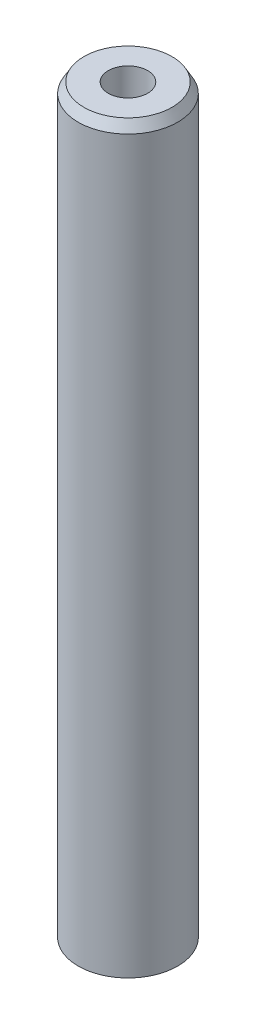
ISO-10303-21;
HEADER;
FILE_DESCRIPTION(('STEP AP214'),'2;1');
FILE_NAME('part.step','',(''),(''),'','','');
FILE_SCHEMA(('AUTOMOTIVE_DESIGN { 1 0 10303 214 1 1 1 1 }'));
ENDSEC;
DATA;
#1=APPLICATION_CONTEXT('core data for automotive mechanical design processes');
#2=APPLICATION_PROTOCOL_DEFINITION('international standard','automotive_design',2000,#1);
#3=PRODUCT_CONTEXT('',#1,'mechanical');
#4=PRODUCT('Part','Part','',(#3));
#5=PRODUCT_RELATED_PRODUCT_CATEGORY('part','',(#4));
#6=PRODUCT_DEFINITION_FORMATION('','',#4);
#7=PRODUCT_DEFINITION_CONTEXT('part definition',#1,'design');
#8=PRODUCT_DEFINITION('design','',#6,#7);
#9=PRODUCT_DEFINITION_SHAPE('','',#8);
#10=(LENGTH_UNIT() NAMED_UNIT(*) SI_UNIT(.MILLI.,.METRE.));
#11=(NAMED_UNIT(*) PLANE_ANGLE_UNIT() SI_UNIT($,.RADIAN.));
#12=(NAMED_UNIT(*) SI_UNIT($,.STERADIAN.) SOLID_ANGLE_UNIT());
#13=UNCERTAINTY_MEASURE_WITH_UNIT(LENGTH_MEASURE(1.E-05),#10,'distance_accuracy_value','');
#14=(GEOMETRIC_REPRESENTATION_CONTEXT(3) GLOBAL_UNCERTAINTY_ASSIGNED_CONTEXT((#13)) GLOBAL_UNIT_ASSIGNED_CONTEXT((#10,
#11,#12)) REPRESENTATION_CONTEXT('',''));
#15=CARTESIAN_POINT('',(0.,0.,0.));
#16=DIRECTION('',(0.,0.,1.));
#17=DIRECTION('',(1.,0.,0.));
#18=AXIS2_PLACEMENT_3D('',#15,#16,#17);
#19=CARTESIAN_POINT('',(0.,224.992049204744,0.));
#20=DIRECTION('',(0.,-1.,0.));
#21=DIRECTION('',(0.,0.,-1.));
#22=AXIS2_PLACEMENT_3D('',#19,#20,#21);
#23=CYLINDRICAL_SURFACE('',#22,15.);
#24=CARTESIAN_POINT('',(0.,221.981035932981,0.));
#25=DIRECTION('',(0.,1.,0.));
#26=DIRECTION('',(0.,0.,1.));
#27=AXIS2_PLACEMENT_3D('',#24,#25,#26);
#28=CIRCLE('',#27,15.);
#29=CARTESIAN_POINT('',(0.,221.981035932981,15.));
#30=VERTEX_POINT('',#29);
#31=EDGE_CURVE('E50',#30,#30,#28,.F.);
#32=ORIENTED_EDGE('',*,*,#31,.T.);
#33=EDGE_LOOP('',(#32));
#34=FACE_BOUND('',#33,.T.);
#35=CARTESIAN_POINT('',(0.,1.7337308484624,0.));
#36=DIRECTION('',(0.,1.,0.));
#37=DIRECTION('',(0.,0.,1.));
#38=AXIS2_PLACEMENT_3D('',#35,#36,#37);
#39=CIRCLE('',#38,15.);
#40=CARTESIAN_POINT('',(0.,1.7337308484624,15.));
#41=VERTEX_POINT('',#40);
#42=EDGE_CURVE('E51',#41,#41,#39,.T.);
#43=ORIENTED_EDGE('',*,*,#42,.T.);
#44=EDGE_LOOP('',(#43));
#45=FACE_BOUND('',#44,.T.);
#46=ADVANCED_FACE('F39',(#34,#45),#23,.T.);
#47=CARTESIAN_POINT('',(0.,224.992049204744,0.));
#48=DIRECTION('',(0.,1.,0.));
#49=DIRECTION('',(0.,0.,1.));
#50=AXIS2_PLACEMENT_3D('',#47,#48,#49);
#51=PLANE('',#50);
#52=CARTESIAN_POINT('',(0.,224.992049204744,0.));
#53=DIRECTION('',(0.,1.,0.));
#54=DIRECTION('',(0.,0.,1.));
#55=AXIS2_PLACEMENT_3D('',#52,#53,#54);
#56=CIRCLE('',#55,13.2662691515376);
#57=CARTESIAN_POINT('',(0.,224.992049204744,13.2662691515376));
#58=VERTEX_POINT('',#57);
#59=EDGE_CURVE('E54',#58,#58,#56,.T.);
#60=ORIENTED_EDGE('',*,*,#59,.T.);
#61=EDGE_LOOP('',(#60));
#62=FACE_BOUND('',#61,.T.);
#63=CARTESIAN_POINT('',(0.,224.992049204744,0.));
#64=DIRECTION('',(0.,1.,0.));
#65=DIRECTION('',(0.,0.,1.));
#66=AXIS2_PLACEMENT_3D('',#63,#64,#65);
#67=CIRCLE('',#66,5.9333030607785);
#68=CARTESIAN_POINT('',(0.,224.992049204744,5.9333030607785));
#69=VERTEX_POINT('',#68);
#70=EDGE_CURVE('E58',#69,#69,#67,.T.);
#71=ORIENTED_EDGE('',*,*,#70,.F.);
#72=EDGE_LOOP('',(#71));
#73=FACE_BOUND('',#72,.T.);
#74=ADVANCED_FACE('F69',(#62,#73),#51,.T.);
#75=CARTESIAN_POINT('',(0.,0.,0.));
#76=DIRECTION('',(0.,1.,0.));
#77=DIRECTION('',(0.,0.,1.));
#78=AXIS2_PLACEMENT_3D('',#75,#76,#77);
#79=PLANE('',#78);
#80=CARTESIAN_POINT('',(0.,0.,0.));
#81=DIRECTION('',(0.,1.,0.));
#82=DIRECTION('',(0.,0.,1.));
#83=AXIS2_PLACEMENT_3D('',#80,#81,#82);
#84=CIRCLE('',#83,11.9889867282377);
#85=CARTESIAN_POINT('',(0.,0.,11.9889867282377));
#86=VERTEX_POINT('',#85);
#87=EDGE_CURVE('E10',#86,#86,#84,.F.);
#88=ORIENTED_EDGE('',*,*,#87,.T.);
#89=EDGE_LOOP('',(#88));
#90=FACE_BOUND('',#89,.T.);
#91=CARTESIAN_POINT('',(0.,0.,0.));
#92=DIRECTION('',(0.,1.,0.));
#93=DIRECTION('',(0.,0.,1.));
#94=AXIS2_PLACEMENT_3D('',#91,#92,#93);
#95=CIRCLE('',#94,5.9333030607785);
#96=CARTESIAN_POINT('',(0.,0.,5.9333030607785));
#97=VERTEX_POINT('',#96);
#98=EDGE_CURVE('E63',#97,#97,#95,.T.);
#99=ORIENTED_EDGE('',*,*,#98,.T.);
#100=EDGE_LOOP('',(#99));
#101=FACE_BOUND('',#100,.T.);
#102=ADVANCED_FACE('F75',(#90,#101),#79,.F.);
#103=CARTESIAN_POINT('',(0.,224.992049204744,0.));
#104=DIRECTION('',(0.,-1.,0.));
#105=DIRECTION('',(0.,0.,-1.));
#106=AXIS2_PLACEMENT_3D('',#103,#104,#105);
#107=CYLINDRICAL_SURFACE('',#106,5.9333030607785);
#108=ORIENTED_EDGE('',*,*,#70,.T.);
#109=EDGE_LOOP('',(#108));
#110=FACE_BOUND('',#109,.T.);
#111=ORIENTED_EDGE('',*,*,#98,.F.);
#112=EDGE_LOOP('',(#111));
#113=FACE_BOUND('',#112,.T.);
#114=ADVANCED_FACE('F70',(#110,#113),#107,.F.);
#115=CARTESIAN_POINT('',(0.,224.992049204744,0.));
#116=DIRECTION('',(0.,-1.,0.));
#117=DIRECTION('',(0.,0.,-1.));
#118=AXIS2_PLACEMENT_3D('',#115,#116,#117);
#119=CONICAL_SURFACE('',#118,13.2662691515376,0.522432650986587);
#120=ORIENTED_EDGE('',*,*,#31,.F.);
#121=EDGE_LOOP('',(#120));
#122=FACE_BOUND('',#121,.T.);
#123=ORIENTED_EDGE('',*,*,#59,.F.);
#124=EDGE_LOOP('',(#123));
#125=FACE_BOUND('',#124,.T.);
#126=ADVANCED_FACE('F81',(#122,#125),#119,.T.);
#127=CARTESIAN_POINT('',(0.,1.7337308484624,0.));
#128=DIRECTION('',(0.,1.,0.));
#129=DIRECTION('',(0.,0.,1.));
#130=AXIS2_PLACEMENT_3D('',#127,#128,#129);
#131=CONICAL_SURFACE('',#130,15.,1.04836367580831);
#132=ORIENTED_EDGE('',*,*,#87,.F.);
#133=EDGE_LOOP('',(#132));
#134=FACE_BOUND('',#133,.T.);
#135=ORIENTED_EDGE('',*,*,#42,.F.);
#136=EDGE_LOOP('',(#135));
#137=FACE_BOUND('',#136,.T.);
#138=ADVANCED_FACE('F45',(#134,#137),#131,.T.);
#139=CLOSED_SHELL('',(#46,#74,#102,#114,#126,#138));
#140=MANIFOLD_SOLID_BREP('B2',#139);
#141=ADVANCED_BREP_SHAPE_REPRESENTATION('',(#18,#140),#14);
#142=SHAPE_DEFINITION_REPRESENTATION(#9,#141);
ENDSEC;
END-ISO-10303-21;
